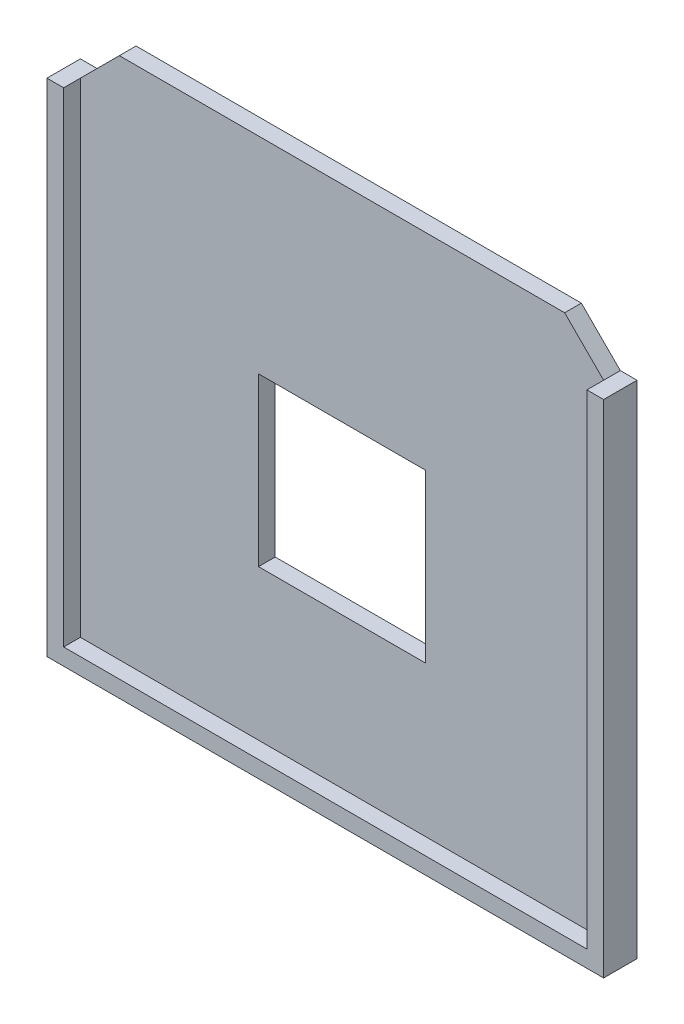
ISO-10303-21;
HEADER;
FILE_DESCRIPTION(('STEP AP214'),'2;1');
FILE_NAME('part.step','',(''),(''),'','','');
FILE_SCHEMA(('AUTOMOTIVE_DESIGN { 1 0 10303 214 1 1 1 1 }'));
ENDSEC;
DATA;
#1=APPLICATION_CONTEXT('core data for automotive mechanical design processes');
#2=APPLICATION_PROTOCOL_DEFINITION('international standard','automotive_design',2000,#1);
#3=PRODUCT_CONTEXT('',#1,'mechanical');
#4=PRODUCT('Part','Part','',(#3));
#5=PRODUCT_RELATED_PRODUCT_CATEGORY('part','',(#4));
#6=PRODUCT_DEFINITION_FORMATION('','',#4);
#7=PRODUCT_DEFINITION_CONTEXT('part definition',#1,'design');
#8=PRODUCT_DEFINITION('design','',#6,#7);
#9=PRODUCT_DEFINITION_SHAPE('','',#8);
#10=(LENGTH_UNIT() NAMED_UNIT(*) SI_UNIT(.MILLI.,.METRE.));
#11=(NAMED_UNIT(*) PLANE_ANGLE_UNIT() SI_UNIT($,.RADIAN.));
#12=(NAMED_UNIT(*) SI_UNIT($,.STERADIAN.) SOLID_ANGLE_UNIT());
#13=UNCERTAINTY_MEASURE_WITH_UNIT(LENGTH_MEASURE(1.E-05),#10,'distance_accuracy_value','');
#14=(GEOMETRIC_REPRESENTATION_CONTEXT(3) GLOBAL_UNCERTAINTY_ASSIGNED_CONTEXT((#13)) GLOBAL_UNIT_ASSIGNED_CONTEXT((#10,
#11,#12)) REPRESENTATION_CONTEXT('',''));
#15=CARTESIAN_POINT('',(0.,0.,0.));
#16=DIRECTION('',(0.,0.,1.));
#17=DIRECTION('',(1.,0.,0.));
#18=AXIS2_PLACEMENT_3D('',#15,#16,#17);
#19=CARTESIAN_POINT('',(47.,45.,3.));
#20=DIRECTION('',(0.,-1.,0.));
#21=DIRECTION('',(0.,0.,-1.));
#22=AXIS2_PLACEMENT_3D('',#19,#20,#21);
#23=PLANE('',#22);
#24=DIRECTION('',(-1.,0.,0.));
#25=VECTOR('',#24,1.);
#26=CARTESIAN_POINT('',(47.,45.,0.));
#27=LINE('',#26,#25);
#28=CARTESIAN_POINT('',(50.,45.,0.));
#29=VERTEX_POINT('',#28);
#30=CARTESIAN_POINT('',(47.,45.,0.));
#31=VERTEX_POINT('',#30);
#32=EDGE_CURVE('E221',#29,#31,#27,.T.);
#33=ORIENTED_EDGE('',*,*,#32,.T.);
#34=DIRECTION('',(0.,0.,-1.));
#35=VECTOR('',#34,1.);
#36=CARTESIAN_POINT('',(47.,45.,3.));
#37=LINE('',#36,#35);
#38=CARTESIAN_POINT('',(47.,45.,3.));
#39=VERTEX_POINT('',#38);
#40=EDGE_CURVE('E11',#39,#31,#37,.T.);
#41=ORIENTED_EDGE('',*,*,#40,.F.);
#42=DIRECTION('',(0.,0.,-1.));
#43=VECTOR('',#42,1.);
#44=CARTESIAN_POINT('',(47.,45.,6.));
#45=LINE('',#44,#43);
#46=CARTESIAN_POINT('',(47.,45.,6.));
#47=VERTEX_POINT('',#46);
#48=EDGE_CURVE('E193',#47,#39,#45,.T.);
#49=ORIENTED_EDGE('',*,*,#48,.F.);
#50=DIRECTION('',(-1.,0.,0.));
#51=VECTOR('',#50,1.);
#52=CARTESIAN_POINT('',(47.,45.,6.));
#53=LINE('',#52,#51);
#54=CARTESIAN_POINT('',(50.,45.,6.));
#55=VERTEX_POINT('',#54);
#56=EDGE_CURVE('E171',#55,#47,#53,.T.);
#57=ORIENTED_EDGE('',*,*,#56,.F.);
#58=DIRECTION('',(0.,0.,-1.));
#59=VECTOR('',#58,1.);
#60=CARTESIAN_POINT('',(50.,45.,3.));
#61=LINE('',#60,#59);
#62=EDGE_CURVE('E234',#55,#29,#61,.T.);
#63=ORIENTED_EDGE('',*,*,#62,.T.);
#64=EDGE_LOOP('',(#33,#41,#49,#57,#63));
#65=FACE_BOUND('',#64,.T.);
#66=ADVANCED_FACE('F34',(#65),#23,.F.);
#67=CARTESIAN_POINT('',(40.,52.,3.));
#68=DIRECTION('',(-0.707106781186549,-0.707106781186546,0.));
#69=DIRECTION('',(0.707106781186546,-0.707106781186549,0.));
#70=AXIS2_PLACEMENT_3D('',#67,#68,#69);
#71=PLANE('',#70);
#72=DIRECTION('',(-0.707106781186546,0.707106781186549,0.));
#73=VECTOR('',#72,1.);
#74=CARTESIAN_POINT('',(40.,52.,0.));
#75=LINE('',#74,#73);
#76=CARTESIAN_POINT('',(40.,52.,0.));
#77=VERTEX_POINT('',#76);
#78=EDGE_CURVE('E237',#31,#77,#75,.T.);
#79=ORIENTED_EDGE('',*,*,#78,.T.);
#80=DIRECTION('',(0.,0.,-1.));
#81=VECTOR('',#80,1.);
#82=CARTESIAN_POINT('',(40.,52.,3.));
#83=LINE('',#82,#81);
#84=CARTESIAN_POINT('',(40.,52.,3.));
#85=VERTEX_POINT('',#84);
#86=EDGE_CURVE('E41',#85,#77,#83,.T.);
#87=ORIENTED_EDGE('',*,*,#86,.F.);
#88=DIRECTION('',(-0.707106781186546,0.707106781186549,0.));
#89=VECTOR('',#88,1.);
#90=CARTESIAN_POINT('',(40.,52.,3.));
#91=LINE('',#90,#89);
#92=EDGE_CURVE('E227',#39,#85,#91,.T.);
#93=ORIENTED_EDGE('',*,*,#92,.F.);
#94=ORIENTED_EDGE('',*,*,#40,.T.);
#95=EDGE_LOOP('',(#79,#87,#93,#94));
#96=FACE_BOUND('',#95,.T.);
#97=ADVANCED_FACE('F296',(#96),#71,.F.);
#98=CARTESIAN_POINT('',(-40.,52.,3.));
#99=DIRECTION('',(0.,-1.,0.));
#100=DIRECTION('',(0.,0.,-1.));
#101=AXIS2_PLACEMENT_3D('',#98,#99,#100);
#102=PLANE('',#101);
#103=DIRECTION('',(-1.,0.,0.));
#104=VECTOR('',#103,1.);
#105=CARTESIAN_POINT('',(-40.,52.,0.));
#106=LINE('',#105,#104);
#107=CARTESIAN_POINT('',(-40.,52.,0.));
#108=VERTEX_POINT('',#107);
#109=EDGE_CURVE('E239',#77,#108,#106,.T.);
#110=ORIENTED_EDGE('',*,*,#109,.T.);
#111=DIRECTION('',(0.,0.,-1.));
#112=VECTOR('',#111,1.);
#113=CARTESIAN_POINT('',(-40.,52.,3.));
#114=LINE('',#113,#112);
#115=CARTESIAN_POINT('',(-40.,52.,3.));
#116=VERTEX_POINT('',#115);
#117=EDGE_CURVE('E256',#116,#108,#114,.T.);
#118=ORIENTED_EDGE('',*,*,#117,.F.);
#119=DIRECTION('',(-1.,0.,0.));
#120=VECTOR('',#119,1.);
#121=CARTESIAN_POINT('',(-40.,52.,3.));
#122=LINE('',#121,#120);
#123=EDGE_CURVE('E229',#85,#116,#122,.T.);
#124=ORIENTED_EDGE('',*,*,#123,.F.);
#125=ORIENTED_EDGE('',*,*,#86,.T.);
#126=EDGE_LOOP('',(#110,#118,#124,#125));
#127=FACE_BOUND('',#126,.T.);
#128=ADVANCED_FACE('F263',(#127),#102,.F.);
#129=CARTESIAN_POINT('',(-47.,45.,3.));
#130=DIRECTION('',(0.707106781186549,-0.707106781186546,0.));
#131=DIRECTION('',(0.707106781186546,0.707106781186549,0.));
#132=AXIS2_PLACEMENT_3D('',#129,#130,#131);
#133=PLANE('',#132);
#134=DIRECTION('',(-0.707106781186546,-0.707106781186549,0.));
#135=VECTOR('',#134,1.);
#136=CARTESIAN_POINT('',(-47.,45.,0.));
#137=LINE('',#136,#135);
#138=CARTESIAN_POINT('',(-47.,45.,0.));
#139=VERTEX_POINT('',#138);
#140=EDGE_CURVE('E241',#108,#139,#137,.T.);
#141=ORIENTED_EDGE('',*,*,#140,.T.);
#142=DIRECTION('',(0.,0.,-1.));
#143=VECTOR('',#142,1.);
#144=CARTESIAN_POINT('',(-47.,45.,3.));
#145=LINE('',#144,#143);
#146=CARTESIAN_POINT('',(-47.,45.,3.));
#147=VERTEX_POINT('',#146);
#148=EDGE_CURVE('E253',#147,#139,#145,.T.);
#149=ORIENTED_EDGE('',*,*,#148,.F.);
#150=DIRECTION('',(-0.707106781186546,-0.707106781186549,0.));
#151=VECTOR('',#150,1.);
#152=CARTESIAN_POINT('',(-47.,45.,3.));
#153=LINE('',#152,#151);
#154=EDGE_CURVE('E232',#116,#147,#153,.T.);
#155=ORIENTED_EDGE('',*,*,#154,.F.);
#156=ORIENTED_EDGE('',*,*,#117,.T.);
#157=EDGE_LOOP('',(#141,#149,#155,#156));
#158=FACE_BOUND('',#157,.T.);
#159=ADVANCED_FACE('F274',(#158),#133,.F.);
#160=CARTESIAN_POINT('',(-50.,45.,3.));
#161=DIRECTION('',(0.,-1.,0.));
#162=DIRECTION('',(0.,0.,-1.));
#163=AXIS2_PLACEMENT_3D('',#160,#161,#162);
#164=PLANE('',#163);
#165=DIRECTION('',(-1.,0.,0.));
#166=VECTOR('',#165,1.);
#167=CARTESIAN_POINT('',(-50.,45.,0.));
#168=LINE('',#167,#166);
#169=CARTESIAN_POINT('',(-50.,45.,0.));
#170=VERTEX_POINT('',#169);
#171=EDGE_CURVE('E243',#139,#170,#168,.T.);
#172=ORIENTED_EDGE('',*,*,#171,.T.);
#173=DIRECTION('',(0.,0.,-1.));
#174=VECTOR('',#173,1.);
#175=CARTESIAN_POINT('',(-50.,45.,3.));
#176=LINE('',#175,#174);
#177=CARTESIAN_POINT('',(-50.,45.,6.));
#178=VERTEX_POINT('',#177);
#179=EDGE_CURVE('E150',#178,#170,#176,.T.);
#180=ORIENTED_EDGE('',*,*,#179,.F.);
#181=DIRECTION('',(-1.,0.,0.));
#182=VECTOR('',#181,1.);
#183=CARTESIAN_POINT('',(-50.,45.,6.));
#184=LINE('',#183,#182);
#185=CARTESIAN_POINT('',(-47.,45.,6.));
#186=VERTEX_POINT('',#185);
#187=EDGE_CURVE('E165',#186,#178,#184,.T.);
#188=ORIENTED_EDGE('',*,*,#187,.F.);
#189=DIRECTION('',(0.,0.,-1.));
#190=VECTOR('',#189,1.);
#191=CARTESIAN_POINT('',(-47.,45.,6.));
#192=LINE('',#191,#190);
#193=EDGE_CURVE('E180',#186,#147,#192,.T.);
#194=ORIENTED_EDGE('',*,*,#193,.T.);
#195=ORIENTED_EDGE('',*,*,#148,.T.);
#196=EDGE_LOOP('',(#172,#180,#188,#194,#195));
#197=FACE_BOUND('',#196,.T.);
#198=ADVANCED_FACE('F277',(#197),#164,.F.);
#199=CARTESIAN_POINT('',(-50.,-45.,3.));
#200=DIRECTION('',(1.,0.,0.));
#201=DIRECTION('',(0.,0.,-1.));
#202=AXIS2_PLACEMENT_3D('',#199,#200,#201);
#203=PLANE('',#202);
#204=DIRECTION('',(0.,-1.,0.));
#205=VECTOR('',#204,1.);
#206=CARTESIAN_POINT('',(-50.,-45.,0.));
#207=LINE('',#206,#205);
#208=CARTESIAN_POINT('',(-50.,-45.,0.));
#209=VERTEX_POINT('',#208);
#210=EDGE_CURVE('E147',#170,#209,#207,.T.);
#211=ORIENTED_EDGE('',*,*,#210,.T.);
#212=DIRECTION('',(0.,0.,-1.));
#213=VECTOR('',#212,1.);
#214=CARTESIAN_POINT('',(-50.,-45.,3.));
#215=LINE('',#214,#213);
#216=CARTESIAN_POINT('',(-50.,-45.,6.));
#217=VERTEX_POINT('',#216);
#218=EDGE_CURVE('E140',#217,#209,#215,.T.);
#219=ORIENTED_EDGE('',*,*,#218,.F.);
#220=DIRECTION('',(0.,-1.,0.));
#221=VECTOR('',#220,1.);
#222=CARTESIAN_POINT('',(-50.,-45.,6.));
#223=LINE('',#222,#221);
#224=EDGE_CURVE('E145',#178,#217,#223,.T.);
#225=ORIENTED_EDGE('',*,*,#224,.F.);
#226=ORIENTED_EDGE('',*,*,#179,.T.);
#227=EDGE_LOOP('',(#211,#219,#225,#226));
#228=FACE_BOUND('',#227,.T.);
#229=ADVANCED_FACE('F142',(#228),#203,.F.);
#230=CARTESIAN_POINT('',(-50.,-45.,3.));
#231=DIRECTION('',(0.,1.,0.));
#232=DIRECTION('',(0.,0.,1.));
#233=AXIS2_PLACEMENT_3D('',#230,#231,#232);
#234=PLANE('',#233);
#235=DIRECTION('',(1.,0.,0.));
#236=VECTOR('',#235,1.);
#237=CARTESIAN_POINT('',(-50.,-45.,0.));
#238=LINE('',#237,#236);
#239=CARTESIAN_POINT('',(50.,-45.,0.));
#240=VERTEX_POINT('',#239);
#241=EDGE_CURVE('E246',#209,#240,#238,.T.);
#242=ORIENTED_EDGE('',*,*,#241,.T.);
#243=DIRECTION('',(0.,0.,-1.));
#244=VECTOR('',#243,1.);
#245=CARTESIAN_POINT('',(50.,-45.,3.));
#246=LINE('',#245,#244);
#247=CARTESIAN_POINT('',(50.,-45.,6.));
#248=VERTEX_POINT('',#247);
#249=EDGE_CURVE('E151',#248,#240,#246,.T.);
#250=ORIENTED_EDGE('',*,*,#249,.F.);
#251=DIRECTION('',(1.,0.,0.));
#252=VECTOR('',#251,1.);
#253=CARTESIAN_POINT('',(50.,-45.,6.));
#254=LINE('',#253,#252);
#255=EDGE_CURVE('E154',#217,#248,#254,.T.);
#256=ORIENTED_EDGE('',*,*,#255,.F.);
#257=ORIENTED_EDGE('',*,*,#218,.T.);
#258=EDGE_LOOP('',(#242,#250,#256,#257));
#259=FACE_BOUND('',#258,.T.);
#260=ADVANCED_FACE('F155',(#259),#234,.F.);
#261=CARTESIAN_POINT('',(50.,-45.,3.));
#262=DIRECTION('',(-1.,0.,0.));
#263=DIRECTION('',(0.,0.,1.));
#264=AXIS2_PLACEMENT_3D('',#261,#262,#263);
#265=PLANE('',#264);
#266=DIRECTION('',(0.,1.,0.));
#267=VECTOR('',#266,1.);
#268=CARTESIAN_POINT('',(50.,-45.,0.));
#269=LINE('',#268,#267);
#270=EDGE_CURVE('E230',#240,#29,#269,.T.);
#271=ORIENTED_EDGE('',*,*,#270,.T.);
#272=ORIENTED_EDGE('',*,*,#62,.F.);
#273=DIRECTION('',(0.,1.,0.));
#274=VECTOR('',#273,1.);
#275=CARTESIAN_POINT('',(50.,45.,6.));
#276=LINE('',#275,#274);
#277=EDGE_CURVE('E160',#248,#55,#276,.T.);
#278=ORIENTED_EDGE('',*,*,#277,.F.);
#279=ORIENTED_EDGE('',*,*,#249,.T.);
#280=EDGE_LOOP('',(#271,#272,#278,#279));
#281=FACE_BOUND('',#280,.T.);
#282=ADVANCED_FACE('F312',(#281),#265,.F.);
#283=CARTESIAN_POINT('',(0.,0.,3.));
#284=DIRECTION('',(0.,0.,1.));
#285=DIRECTION('',(1.,0.,0.));
#286=AXIS2_PLACEMENT_3D('',#283,#284,#285);
#287=PLANE('',#286);
#288=DIRECTION('',(0.,1.,0.));
#289=VECTOR('',#288,1.);
#290=CARTESIAN_POINT('',(-47.,45.,3.));
#291=LINE('',#290,#289);
#292=CARTESIAN_POINT('',(-47.,-42.,3.));
#293=VERTEX_POINT('',#292);
#294=EDGE_CURVE('E48',#293,#147,#291,.T.);
#295=ORIENTED_EDGE('',*,*,#294,.F.);
#296=DIRECTION('',(-1.,0.,0.));
#297=VECTOR('',#296,1.);
#298=CARTESIAN_POINT('',(-47.,-42.,3.));
#299=LINE('',#298,#297);
#300=CARTESIAN_POINT('',(47.,-42.,3.));
#301=VERTEX_POINT('',#300);
#302=EDGE_CURVE('E167',#301,#293,#299,.T.);
#303=ORIENTED_EDGE('',*,*,#302,.F.);
#304=DIRECTION('',(0.,-1.,0.));
#305=VECTOR('',#304,1.);
#306=CARTESIAN_POINT('',(47.,-42.,3.));
#307=LINE('',#306,#305);
#308=EDGE_CURVE('E181',#39,#301,#307,.T.);
#309=ORIENTED_EDGE('',*,*,#308,.F.);
#310=ORIENTED_EDGE('',*,*,#92,.T.);
#311=ORIENTED_EDGE('',*,*,#123,.T.);
#312=ORIENTED_EDGE('',*,*,#154,.T.);
#313=EDGE_LOOP('',(#295,#303,#309,#310,#311,#312));
#314=FACE_BOUND('',#313,.T.);
#315=DIRECTION('',(0.,1.,0.));
#316=VECTOR('',#315,1.);
#317=CARTESIAN_POINT('',(15.,-15.,3.));
#318=LINE('',#317,#316);
#319=CARTESIAN_POINT('',(15.,-15.,3.));
#320=VERTEX_POINT('',#319);
#321=CARTESIAN_POINT('',(15.,15.,3.));
#322=VERTEX_POINT('',#321);
#323=EDGE_CURVE('E56',#320,#322,#318,.T.);
#324=ORIENTED_EDGE('',*,*,#323,.F.);
#325=DIRECTION('',(1.,0.,0.));
#326=VECTOR('',#325,1.);
#327=CARTESIAN_POINT('',(-15.,-15.,3.));
#328=LINE('',#327,#326);
#329=CARTESIAN_POINT('',(-15.,-15.,3.));
#330=VERTEX_POINT('',#329);
#331=EDGE_CURVE('E200',#330,#320,#328,.T.);
#332=ORIENTED_EDGE('',*,*,#331,.F.);
#333=DIRECTION('',(0.,-1.,0.));
#334=VECTOR('',#333,1.);
#335=CARTESIAN_POINT('',(-15.,-15.,3.));
#336=LINE('',#335,#334);
#337=CARTESIAN_POINT('',(-15.,15.,3.));
#338=VERTEX_POINT('',#337);
#339=EDGE_CURVE('E214',#338,#330,#336,.T.);
#340=ORIENTED_EDGE('',*,*,#339,.F.);
#341=DIRECTION('',(-1.,0.,0.));
#342=VECTOR('',#341,1.);
#343=CARTESIAN_POINT('',(-15.,15.,3.));
#344=LINE('',#343,#342);
#345=EDGE_CURVE('E211',#322,#338,#344,.T.);
#346=ORIENTED_EDGE('',*,*,#345,.F.);
#347=EDGE_LOOP('',(#324,#332,#340,#346));
#348=FACE_BOUND('',#347,.T.);
#349=ADVANCED_FACE('F287',(#314,#348),#287,.T.);
#350=CARTESIAN_POINT('',(0.,0.,0.));
#351=DIRECTION('',(0.,0.,1.));
#352=DIRECTION('',(1.,0.,0.));
#353=AXIS2_PLACEMENT_3D('',#350,#351,#352);
#354=PLANE('',#353);
#355=DIRECTION('',(1.,0.,0.));
#356=VECTOR('',#355,1.);
#357=CARTESIAN_POINT('',(-15.,-15.,0.));
#358=LINE('',#357,#356);
#359=CARTESIAN_POINT('',(-15.,-15.,0.));
#360=VERTEX_POINT('',#359);
#361=CARTESIAN_POINT('',(15.,-15.,0.));
#362=VERTEX_POINT('',#361);
#363=EDGE_CURVE('E206',#360,#362,#358,.T.);
#364=ORIENTED_EDGE('',*,*,#363,.T.);
#365=DIRECTION('',(0.,1.,0.));
#366=VECTOR('',#365,1.);
#367=CARTESIAN_POINT('',(15.,-15.,0.));
#368=LINE('',#367,#366);
#369=CARTESIAN_POINT('',(15.,15.,0.));
#370=VERTEX_POINT('',#369);
#371=EDGE_CURVE('E196',#362,#370,#368,.T.);
#372=ORIENTED_EDGE('',*,*,#371,.T.);
#373=DIRECTION('',(-1.,0.,0.));
#374=VECTOR('',#373,1.);
#375=CARTESIAN_POINT('',(-15.,15.,0.));
#376=LINE('',#375,#374);
#377=CARTESIAN_POINT('',(-15.,15.,0.));
#378=VERTEX_POINT('',#377);
#379=EDGE_CURVE('E199',#370,#378,#376,.T.);
#380=ORIENTED_EDGE('',*,*,#379,.T.);
#381=DIRECTION('',(0.,-1.,0.));
#382=VECTOR('',#381,1.);
#383=CARTESIAN_POINT('',(-15.,-15.,0.));
#384=LINE('',#383,#382);
#385=EDGE_CURVE('E203',#378,#360,#384,.T.);
#386=ORIENTED_EDGE('',*,*,#385,.T.);
#387=EDGE_LOOP('',(#364,#372,#380,#386));
#388=FACE_BOUND('',#387,.T.);
#389=ORIENTED_EDGE('',*,*,#32,.F.);
#390=ORIENTED_EDGE('',*,*,#270,.F.);
#391=ORIENTED_EDGE('',*,*,#241,.F.);
#392=ORIENTED_EDGE('',*,*,#210,.F.);
#393=ORIENTED_EDGE('',*,*,#171,.F.);
#394=ORIENTED_EDGE('',*,*,#140,.F.);
#395=ORIENTED_EDGE('',*,*,#109,.F.);
#396=ORIENTED_EDGE('',*,*,#78,.F.);
#397=EDGE_LOOP('',(#389,#390,#391,#392,#393,#394,#395,#396));
#398=FACE_BOUND('',#397,.T.);
#399=ADVANCED_FACE('F270',(#388,#398),#354,.F.);
#400=CARTESIAN_POINT('',(15.,-15.,0.));
#401=DIRECTION('',(1.,0.,0.));
#402=DIRECTION('',(0.,0.,-1.));
#403=AXIS2_PLACEMENT_3D('',#400,#401,#402);
#404=PLANE('',#403);
#405=ORIENTED_EDGE('',*,*,#323,.T.);
#406=DIRECTION('',(0.,0.,1.));
#407=VECTOR('',#406,1.);
#408=CARTESIAN_POINT('',(15.,15.,0.));
#409=LINE('',#408,#407);
#410=EDGE_CURVE('E209',#370,#322,#409,.T.);
#411=ORIENTED_EDGE('',*,*,#410,.F.);
#412=ORIENTED_EDGE('',*,*,#371,.F.);
#413=DIRECTION('',(0.,0.,1.));
#414=VECTOR('',#413,1.);
#415=CARTESIAN_POINT('',(15.,-15.,0.));
#416=LINE('',#415,#414);
#417=EDGE_CURVE('E219',#362,#320,#416,.T.);
#418=ORIENTED_EDGE('',*,*,#417,.T.);
#419=EDGE_LOOP('',(#405,#411,#412,#418));
#420=FACE_BOUND('',#419,.T.);
#421=ADVANCED_FACE('F318',(#420),#404,.F.);
#422=CARTESIAN_POINT('',(-15.,-15.,0.));
#423=DIRECTION('',(0.,-1.,0.));
#424=DIRECTION('',(0.,0.,-1.));
#425=AXIS2_PLACEMENT_3D('',#422,#423,#424);
#426=PLANE('',#425);
#427=ORIENTED_EDGE('',*,*,#331,.T.);
#428=ORIENTED_EDGE('',*,*,#417,.F.);
#429=ORIENTED_EDGE('',*,*,#363,.F.);
#430=DIRECTION('',(0.,0.,1.));
#431=VECTOR('',#430,1.);
#432=CARTESIAN_POINT('',(-15.,-15.,0.));
#433=LINE('',#432,#431);
#434=EDGE_CURVE('E222',#360,#330,#433,.T.);
#435=ORIENTED_EDGE('',*,*,#434,.T.);
#436=EDGE_LOOP('',(#427,#428,#429,#435));
#437=FACE_BOUND('',#436,.T.);
#438=ADVANCED_FACE('F324',(#437),#426,.F.);
#439=CARTESIAN_POINT('',(-15.,-15.,0.));
#440=DIRECTION('',(-1.,0.,0.));
#441=DIRECTION('',(0.,0.,1.));
#442=AXIS2_PLACEMENT_3D('',#439,#440,#441);
#443=PLANE('',#442);
#444=ORIENTED_EDGE('',*,*,#339,.T.);
#445=ORIENTED_EDGE('',*,*,#434,.F.);
#446=ORIENTED_EDGE('',*,*,#385,.F.);
#447=DIRECTION('',(0.,0.,1.));
#448=VECTOR('',#447,1.);
#449=CARTESIAN_POINT('',(-15.,15.,0.));
#450=LINE('',#449,#448);
#451=EDGE_CURVE('E224',#378,#338,#450,.T.);
#452=ORIENTED_EDGE('',*,*,#451,.T.);
#453=EDGE_LOOP('',(#444,#445,#446,#452));
#454=FACE_BOUND('',#453,.T.);
#455=ADVANCED_FACE('F328',(#454),#443,.F.);
#456=CARTESIAN_POINT('',(-15.,15.,0.));
#457=DIRECTION('',(0.,1.,0.));
#458=DIRECTION('',(0.,0.,1.));
#459=AXIS2_PLACEMENT_3D('',#456,#457,#458);
#460=PLANE('',#459);
#461=ORIENTED_EDGE('',*,*,#345,.T.);
#462=ORIENTED_EDGE('',*,*,#451,.F.);
#463=ORIENTED_EDGE('',*,*,#379,.F.);
#464=ORIENTED_EDGE('',*,*,#410,.T.);
#465=EDGE_LOOP('',(#461,#462,#463,#464));
#466=FACE_BOUND('',#465,.T.);
#467=ADVANCED_FACE('F325',(#466),#460,.F.);
#468=CARTESIAN_POINT('',(47.,-42.,6.));
#469=DIRECTION('',(1.,0.,0.));
#470=DIRECTION('',(0.,0.,-1.));
#471=AXIS2_PLACEMENT_3D('',#468,#469,#470);
#472=PLANE('',#471);
#473=ORIENTED_EDGE('',*,*,#308,.T.);
#474=DIRECTION('',(0.,0.,-1.));
#475=VECTOR('',#474,1.);
#476=CARTESIAN_POINT('',(47.,-42.,6.));
#477=LINE('',#476,#475);
#478=CARTESIAN_POINT('',(47.,-42.,6.));
#479=VERTEX_POINT('',#478);
#480=EDGE_CURVE('E190',#479,#301,#477,.T.);
#481=ORIENTED_EDGE('',*,*,#480,.F.);
#482=DIRECTION('',(0.,-1.,0.));
#483=VECTOR('',#482,1.);
#484=CARTESIAN_POINT('',(47.,-42.,6.));
#485=LINE('',#484,#483);
#486=EDGE_CURVE('E173',#47,#479,#485,.T.);
#487=ORIENTED_EDGE('',*,*,#486,.F.);
#488=ORIENTED_EDGE('',*,*,#48,.T.);
#489=EDGE_LOOP('',(#473,#481,#487,#488));
#490=FACE_BOUND('',#489,.T.);
#491=ADVANCED_FACE('F290',(#490),#472,.F.);
#492=CARTESIAN_POINT('',(-47.,-42.,6.));
#493=DIRECTION('',(0.,-1.,0.));
#494=DIRECTION('',(0.,0.,-1.));
#495=AXIS2_PLACEMENT_3D('',#492,#493,#494);
#496=PLANE('',#495);
#497=ORIENTED_EDGE('',*,*,#302,.T.);
#498=DIRECTION('',(0.,0.,-1.));
#499=VECTOR('',#498,1.);
#500=CARTESIAN_POINT('',(-47.,-42.,6.));
#501=LINE('',#500,#499);
#502=CARTESIAN_POINT('',(-47.,-42.,6.));
#503=VERTEX_POINT('',#502);
#504=EDGE_CURVE('E187',#503,#293,#501,.T.);
#505=ORIENTED_EDGE('',*,*,#504,.F.);
#506=DIRECTION('',(-1.,0.,0.));
#507=VECTOR('',#506,1.);
#508=CARTESIAN_POINT('',(-47.,-42.,6.));
#509=LINE('',#508,#507);
#510=EDGE_CURVE('E175',#479,#503,#509,.T.);
#511=ORIENTED_EDGE('',*,*,#510,.F.);
#512=ORIENTED_EDGE('',*,*,#480,.T.);
#513=EDGE_LOOP('',(#497,#505,#511,#512));
#514=FACE_BOUND('',#513,.T.);
#515=ADVANCED_FACE('F285',(#514),#496,.F.);
#516=CARTESIAN_POINT('',(-47.,45.,6.));
#517=DIRECTION('',(-1.,0.,0.));
#518=DIRECTION('',(0.,-1.,0.));
#519=AXIS2_PLACEMENT_3D('',#516,#517,#518);
#520=PLANE('',#519);
#521=ORIENTED_EDGE('',*,*,#294,.T.);
#522=ORIENTED_EDGE('',*,*,#193,.F.);
#523=DIRECTION('',(0.,1.,0.));
#524=VECTOR('',#523,1.);
#525=CARTESIAN_POINT('',(-47.,45.,6.));
#526=LINE('',#525,#524);
#527=EDGE_CURVE('E177',#503,#186,#526,.T.);
#528=ORIENTED_EDGE('',*,*,#527,.F.);
#529=ORIENTED_EDGE('',*,*,#504,.T.);
#530=EDGE_LOOP('',(#521,#522,#528,#529));
#531=FACE_BOUND('',#530,.T.);
#532=ADVANCED_FACE('F281',(#531),#520,.F.);
#533=CARTESIAN_POINT('',(0.,0.,6.));
#534=DIRECTION('',(0.,0.,-1.));
#535=DIRECTION('',(-1.,0.,0.));
#536=AXIS2_PLACEMENT_3D('',#533,#534,#535);
#537=PLANE('',#536);
#538=ORIENTED_EDGE('',*,*,#224,.T.);
#539=ORIENTED_EDGE('',*,*,#255,.T.);
#540=ORIENTED_EDGE('',*,*,#277,.T.);
#541=ORIENTED_EDGE('',*,*,#56,.T.);
#542=ORIENTED_EDGE('',*,*,#486,.T.);
#543=ORIENTED_EDGE('',*,*,#510,.T.);
#544=ORIENTED_EDGE('',*,*,#527,.T.);
#545=ORIENTED_EDGE('',*,*,#187,.T.);
#546=EDGE_LOOP('',(#538,#539,#540,#541,#542,#543,#544,#545));
#547=FACE_BOUND('',#546,.T.);
#548=ADVANCED_FACE('F163',(#547),#537,.F.);
#549=CLOSED_SHELL('',(#66,#97,#128,#159,#198,#229,#260,#282,#349,#399,#421,#438,#455,#467,#491,
#515,#532,#548));
#550=MANIFOLD_SOLID_BREP('B2',#549);
#551=ADVANCED_BREP_SHAPE_REPRESENTATION('',(#18,#550),#14);
#552=SHAPE_DEFINITION_REPRESENTATION(#9,#551);
ENDSEC;
END-ISO-10303-21;
